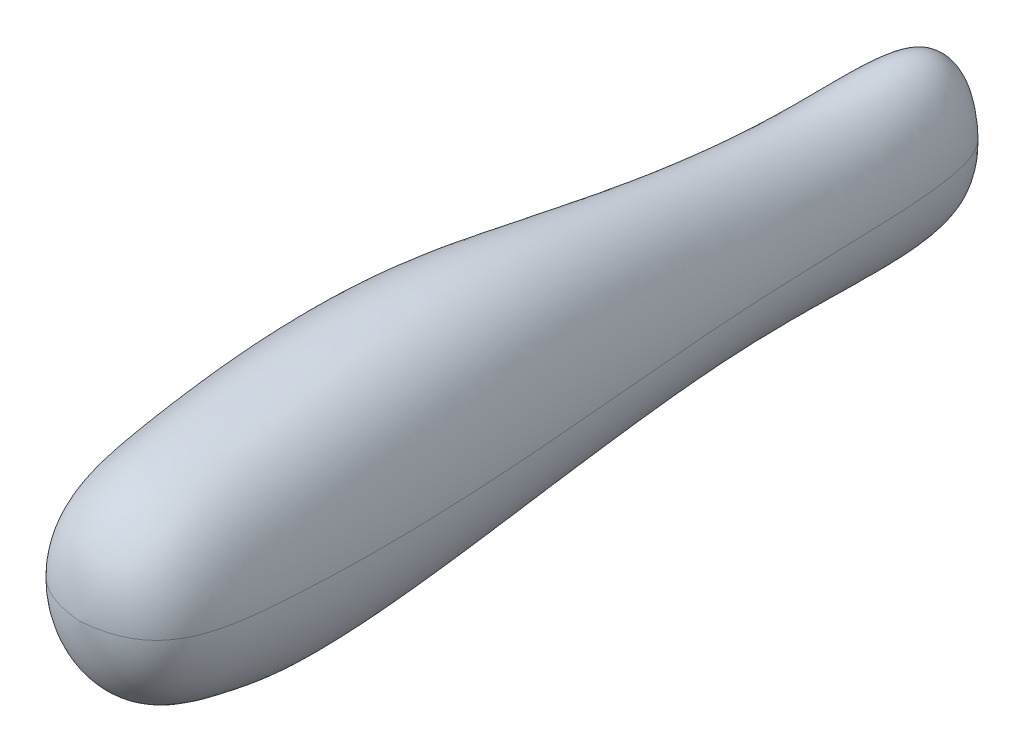
ISO-10303-21;
HEADER;
FILE_DESCRIPTION(('STEP AP214'),'2;1');
FILE_NAME('part.step','',(''),(''),'','','');
FILE_SCHEMA(('AUTOMOTIVE_DESIGN { 1 0 10303 214 1 1 1 1 }'));
ENDSEC;
DATA;
#1=APPLICATION_CONTEXT('core data for automotive mechanical design processes');
#2=APPLICATION_PROTOCOL_DEFINITION('international standard','automotive_design',2000,#1);
#3=PRODUCT_CONTEXT('',#1,'mechanical');
#4=PRODUCT('Part','Part','',(#3));
#5=PRODUCT_RELATED_PRODUCT_CATEGORY('part','',(#4));
#6=PRODUCT_DEFINITION_FORMATION('','',#4);
#7=PRODUCT_DEFINITION_CONTEXT('part definition',#1,'design');
#8=PRODUCT_DEFINITION('design','',#6,#7);
#9=PRODUCT_DEFINITION_SHAPE('','',#8);
#10=(LENGTH_UNIT() NAMED_UNIT(*) SI_UNIT(.MILLI.,.METRE.));
#11=(NAMED_UNIT(*) PLANE_ANGLE_UNIT() SI_UNIT($,.RADIAN.));
#12=(NAMED_UNIT(*) SI_UNIT($,.STERADIAN.) SOLID_ANGLE_UNIT());
#13=UNCERTAINTY_MEASURE_WITH_UNIT(LENGTH_MEASURE(1.E-05),#10,'distance_accuracy_value','');
#14=(GEOMETRIC_REPRESENTATION_CONTEXT(3) GLOBAL_UNCERTAINTY_ASSIGNED_CONTEXT((#13)) GLOBAL_UNIT_ASSIGNED_CONTEXT((#10,
#11,#12)) REPRESENTATION_CONTEXT('',''));
#15=CARTESIAN_POINT('',(0.,0.,0.));
#16=DIRECTION('',(0.,0.,1.));
#17=DIRECTION('',(1.,0.,0.));
#18=AXIS2_PLACEMENT_3D('',#15,#16,#17);
#19=CARTESIAN_POINT('',(204.079130800969,23.172812466691,203.55366286516));
#20=CARTESIAN_POINT('',(204.079130800969,23.172812466691,203.55366286516));
#21=CARTESIAN_POINT('',(204.079130800969,23.172812466691,203.55366286516));
#22=CARTESIAN_POINT('',(204.079130800969,23.172812466691,203.55366286516));
#23=CARTESIAN_POINT('',(204.079130800969,23.172812466691,203.55366286516));
#24=CARTESIAN_POINT('',(204.079130800969,23.172812466691,203.55366286516));
#25=CARTESIAN_POINT('',(204.079130800969,23.172812466691,203.55366286516));
#26=CARTESIAN_POINT('',(228.446348021599,23.172812336409,201.663956001106));
#27=CARTESIAN_POINT('',(228.446347912663,30.7846047284761,201.663956001109));
#28=CARTESIAN_POINT('',(223.173565154511,46.0081892520745,201.663956001109));
#29=CARTESIAN_POINT('',(204.079130800972,55.4669114657685,201.663956001107));
#30=CARTESIAN_POINT('',(184.98469710099,46.0081884704591,201.663956001117));
#31=CARTESIAN_POINT('',(179.711915139516,30.7846044679457,201.663956001111));
#32=CARTESIAN_POINT('',(179.711915248448,23.1728125969489,201.663956001115));
#33=CARTESIAN_POINT('',(235.098969024617,23.1728123008377,167.649331490651));
#34=CARTESIAN_POINT('',(235.098968885954,32.8627398151723,167.649331490652));
#35=CARTESIAN_POINT('',(228.386636219257,52.2425945121602,167.649331490648));
#36=CARTESIAN_POINT('',(204.079130800961,64.2836917870697,167.649331490662));
#37=CARTESIAN_POINT('',(179.77162621468,52.2425935171488,167.649331490658));
#38=CARTESIAN_POINT('',(173.059294562173,32.8627394835153,167.649331490655));
#39=CARTESIAN_POINT('',(173.059294700834,23.1728126325323,167.649331490669));
#40=CARTESIAN_POINT('',(235.098969024623,23.1728123750451,93.0514367049417));
#41=CARTESIAN_POINT('',(235.098968885947,34.8572991008661,82.7804555502548));
#42=CARTESIAN_POINT('',(228.386636219259,58.2262723692105,75.712253518332));
#43=CARTESIAN_POINT('',(204.079130800954,70.2673696440928,75.7122535183184));
#44=CARTESIAN_POINT('',(173.445767749334,58.2262713742114,75.7122535183253));
#45=CARTESIAN_POINT('',(166.733436096823,34.8572987691856,82.7804555502539));
#46=CARTESIAN_POINT('',(166.733436235497,23.1728127067216,93.0514367049448));
#47=CARTESIAN_POINT('',(225.360000997944,23.909585599789,-3.5964441130224));
#48=CARTESIAN_POINT('',(225.36000089106,30.7712887533313,-4.72272252781647));
#49=CARTESIAN_POINT('',(220.185890610066,45.9682413266295,-6.97831727334741));
#50=CARTESIAN_POINT('',(201.448780884544,56.8976297743393,-6.97831727335119));
#51=CARTESIAN_POINT('',(189.564685137818,45.9682404234728,28.5733600990669));
#52=CARTESIAN_POINT('',(180.524773243102,30.7712884522742,46.6297002549572));
#53=CARTESIAN_POINT('',(180.524773349987,23.9095859008565,47.75597866975));
#54=CARTESIAN_POINT('',(222.974014375893,22.0127801573795,-88.5817557809556));
#55=CARTESIAN_POINT('',(222.974014300903,28.4969285711436,-88.0361594976015));
#56=CARTESIAN_POINT('',(219.343886979926,39.1451607800799,-85.853774364172));
#57=CARTESIAN_POINT('',(204.089414342485,48.6441298861113,-76.7379597415512));
#58=CARTESIAN_POINT('',(190.943561643473,39.145159995136,-76.7379597415583));
#59=CARTESIAN_POINT('',(187.313434870997,28.4969283094975,-78.9203448749846));
#60=CARTESIAN_POINT('',(187.31343494599,22.0127804190149,-79.4659411583349));
#61=CARTESIAN_POINT('',(218.997547134608,24.4761486457395,-98.6473785735476));
#62=CARTESIAN_POINT('',(218.997547067958,32.5725578735719,-98.6473785735502));
#63=CARTESIAN_POINT('',(215.771600303875,51.3720486873408,-98.6473785735478));
#64=CARTESIAN_POINT('',(204.089414342492,59.8133968661447,-98.6473785735468));
#65=CARTESIAN_POINT('',(192.407228780965,51.3720479898105,-98.6473785735384));
#66=CARTESIAN_POINT('',(189.181282504312,32.5725576410558,-98.6473785735499));
#67=CARTESIAN_POINT('',(189.181282570963,24.4761488782488,-98.6473785735397));
#68=CARTESIAN_POINT('',(204.089414342496,23.1728124666768,-101.04566944612));
#69=CARTESIAN_POINT('',(204.089414342496,23.1728124666768,-101.04566944612));
#70=CARTESIAN_POINT('',(204.089414342496,23.1728124666768,-101.04566944612));
#71=CARTESIAN_POINT('',(204.089414342496,23.1728124666768,-101.04566944612));
#72=CARTESIAN_POINT('',(204.089414342496,23.1728124666768,-101.04566944612));
#73=CARTESIAN_POINT('',(204.089414342496,23.1728124666768,-101.04566944612));
#74=CARTESIAN_POINT('',(204.089414342496,23.1728124666768,-101.04566944612));
#75=B_SPLINE_SURFACE_WITH_KNOTS('',3,3,((#19,#20,#21,#22,#23,#24,#25),(#26,#27,#28,#29,#30,#31,
#32),(#33,#34,#35,#36,#37,#38,#39),(#40,#41,#42,#43,#44,#45,#46),(#47,#48,#49,#50,#51,#52,#53),
(#54,#55,#56,#57,#58,#59,#60),(#61,#62,#63,#64,#65,#66,#67),(#68,#69,#70,#71,#72,#73,#74)),
.UNSPECIFIED.,.F.,.F.,.F.,(4,1,1,1,1,4),(4,1,1,1,4),(0.,1.,2.,2.582463818436,3.,4.),(2.,3.,4.,
5.,6.),.UNSPECIFIED.);
#76=CARTESIAN_POINT('',(204.079130800969,23.172812466691,203.55366286516));
#77=CARTESIAN_POINT('',(179.711915248448,23.1728125969489,201.663956001115));
#78=CARTESIAN_POINT('',(173.059294700834,23.1728126325323,167.649331490669));
#79=CARTESIAN_POINT('',(166.733436235497,23.1728127067216,93.0514367049448));
#80=CARTESIAN_POINT('',(180.524773349987,23.9095859008565,47.75597866975));
#81=CARTESIAN_POINT('',(187.31343494599,22.0127804190149,-79.4659411583349));
#82=CARTESIAN_POINT('',(189.181282570963,24.4761488782488,-98.6473785735397));
#83=CARTESIAN_POINT('',(204.089414342496,23.1728124666768,-101.04566944612));
#84=B_SPLINE_CURVE_WITH_KNOTS('',3,(#76,#77,#78,#79,#80,#81,#82,#83),.UNSPECIFIED.,.F.,.F.,(4,1,
1,1,1,4),(0.,1.,2.,2.582463818436,3.,4.),.UNSPECIFIED.);
#85=CARTESIAN_POINT('',(174.42358175533,23.1728126308659,168.581491178922));
#86=VERTEX_POINT('',#85);
#87=CARTESIAN_POINT('',(187.661687822029,23.1431852475548,-71.9357518170439));
#88=VERTEX_POINT('',#87);
#89=EDGE_CURVE('E58',#86,#88,#84,.T.);
#90=CARTESIAN_POINT('',(176.272590131765,23.1728126184513,178.544058142151));
#91=CARTESIAN_POINT('',(176.27259147372,23.1742073772134,178.543937120343));
#92=CARTESIAN_POINT('',(176.272592747765,23.1756020852418,178.543815512753));
#93=CARTESIAN_POINT('',(176.27259762969,23.1812471282352,178.543320920337));
#94=CARTESIAN_POINT('',(176.272600674629,23.1854970388554,178.542943080768));
#95=CARTESIAN_POINT('',(176.272612743577,23.2067443598892,178.541026664954));
#96=CARTESIAN_POINT('',(176.272612299722,23.2237344389797,178.539406489905));
#97=CARTESIAN_POINT('',(176.272559498785,23.308655390227,178.530869505678));
#98=CARTESIAN_POINT('',(176.27235535743,23.3764572396979,178.522647899677));
#99=CARTESIAN_POINT('',(176.271250785307,23.5797669271,178.49375460985));
#100=CARTESIAN_POINT('',(176.269856193009,23.7146985041849,178.468882916024));
#101=CARTESIAN_POINT('',(176.265728000614,23.9821802974991,178.408112166413));
#102=CARTESIAN_POINT('',(176.262992861931,24.1147275955657,178.372200457365));
#103=CARTESIAN_POINT('',(176.256112678793,24.3780910018452,178.289074175646));
#104=CARTESIAN_POINT('',(176.251949809566,24.5088623654704,178.241719058315));
#105=CARTESIAN_POINT('',(176.242192108236,24.7660092236984,178.136285656755));
#106=CARTESIAN_POINT('',(176.236596733952,24.8923830332776,178.078203314761));
#107=CARTESIAN_POINT('',(176.223939270042,25.1399105983093,177.951693076617));
#108=CARTESIAN_POINT('',(176.216875851871,25.2610595046003,177.883255824892));
#109=CARTESIAN_POINT('',(176.201253726611,25.4972099279122,177.736548275552));
#110=CARTESIAN_POINT('',(176.192694465996,25.61220914864,177.658274340965));
#111=CARTESIAN_POINT('',(176.17402342929,25.8356084925875,177.492191022658));
#112=CARTESIAN_POINT('',(176.163906231309,25.9439836485927,177.40434866421));
#113=CARTESIAN_POINT('',(176.142116970653,26.1529714219875,177.219971674675));
#114=CARTESIAN_POINT('',(176.130444335534,26.2535811598539,177.123433847671));
#115=CARTESIAN_POINT('',(176.105542072206,26.446238855841,176.922468581194));
#116=CARTESIAN_POINT('',(176.092313444935,26.5382922505879,176.818046228995));
#117=CARTESIAN_POINT('',(176.064285341478,26.7133174673212,176.601982950858));
#118=CARTESIAN_POINT('',(176.049485286801,26.796285921871,176.490339372516));
#119=CARTESIAN_POINT('',(176.018259522726,26.9528939731599,176.260175397742));
#120=CARTESIAN_POINT('',(176.001826932042,27.0264908161852,176.141626845873));
#121=CARTESIAN_POINT('',(175.96741050257,27.1634657146962,175.89892732133));
#122=CARTESIAN_POINT('',(175.949426126776,27.226840210737,175.774774416384));
#123=CARTESIAN_POINT('',(175.911955767562,27.3429303711949,175.521816166715));
#124=CARTESIAN_POINT('',(175.892469935328,27.3956471068393,175.393011291105));
#125=CARTESIAN_POINT('',(175.85205705196,27.4901087728368,175.131658316893));
#126=CARTESIAN_POINT('',(175.831129979576,27.5318535413744,174.999110163117));
#127=CARTESIAN_POINT('',(175.787690740676,27.6045100411465,174.729802380589));
#128=CARTESIAN_POINT('',(175.765164246902,27.6353035153075,174.593013156031));
#129=CARTESIAN_POINT('',(175.71883997655,27.6852694180775,174.317589657337));
#130=CARTESIAN_POINT('',(175.695042615048,27.7044456160306,174.178955996581));
#131=CARTESIAN_POINT('',(175.646290830146,27.7311164630096,173.900714650698));
#132=CARTESIAN_POINT('',(175.621335946422,27.7386064229253,173.761106597152));
#133=CARTESIAN_POINT('',(175.570440805377,27.7418862718452,173.481984332353));
#134=CARTESIAN_POINT('',(175.544500890605,27.7376801921164,173.342470105341));
#135=CARTESIAN_POINT('',(175.491391193502,27.7174907285628,173.062260191718));
#136=CARTESIAN_POINT('',(175.464208526005,27.7013243103574,172.921580117051));
#137=CARTESIAN_POINT('',(175.409216131243,27.6571608101464,172.642267216208));
#138=CARTESIAN_POINT('',(175.381406624593,27.6291678307841,172.503633697324));
#139=CARTESIAN_POINT('',(175.325366066536,27.5615547874272,172.229249639924));
#140=CARTESIAN_POINT('',(175.29713482993,27.5219294636815,172.093500435438));
#141=CARTESIAN_POINT('',(175.240520284688,27.4313579957104,171.825922411031));
#142=CARTESIAN_POINT('',(175.212137033873,27.3804158937658,171.694092210282));
#143=CARTESIAN_POINT('',(175.15509604427,27.2668020135227,171.433480484213));
#144=CARTESIAN_POINT('',(175.126439649441,27.203983806413,171.304762469369));
#145=CARTESIAN_POINT('',(175.069526650293,27.0675160300688,171.053152315772));
#146=CARTESIAN_POINT('',(175.041269949086,26.9938691369127,170.930258747525));
#147=CARTESIAN_POINT('',(174.985462411693,26.8362589041016,170.691189793031));
#148=CARTESIAN_POINT('',(174.957911252248,26.7523003949886,170.575011298293));
#149=CARTESIAN_POINT('',(174.903780357641,26.5744984886449,170.350028398356));
#150=CARTESIAN_POINT('',(174.877201689466,26.4806446482091,170.241231986993));
#151=CARTESIAN_POINT('',(174.825415432539,26.2839589068844,170.032179514216));
#152=CARTESIAN_POINT('',(174.800205033911,26.1811466301056,169.93190569084));
#153=CARTESIAN_POINT('',(174.751405213163,25.9670617109931,169.740404062676));
#154=CARTESIAN_POINT('',(174.727815753874,25.8557892627826,169.649176050436));
#155=CARTESIAN_POINT('',(174.68256152406,25.6255399991445,169.476482578054));
#156=CARTESIAN_POINT('',(174.660896760309,25.5065631566035,169.39501715227));
#157=CARTESIAN_POINT('',(174.619794432485,25.2617970078685,169.242554603141));
#158=CARTESIAN_POINT('',(174.600355757761,25.1360111453983,169.171552254401));
#159=CARTESIAN_POINT('',(174.564333340131,24.8810771826636,169.041894282623));
#160=CARTESIAN_POINT('',(174.547699935776,24.7520480137588,168.983018577476));
#161=CARTESIAN_POINT('',(174.517065267769,24.4892781308021,168.876391985818));
#162=CARTESIAN_POINT('',(174.503062048331,24.3555410061232,168.828632826761));
#163=CARTESIAN_POINT('',(174.477898604555,24.084510593429,168.744686400538));
#164=CARTESIAN_POINT('',(174.466733014175,23.9472245666314,168.708477258339));
#165=CARTESIAN_POINT('',(174.44737767875,23.6699090754356,168.647849109315));
#166=CARTESIAN_POINT('',(174.439186401335,23.5298810630166,168.623424029187));
#167=CARTESIAN_POINT('',(174.430846153904,23.3530931900097,168.600299502843));
#168=CARTESIAN_POINT('',(174.429250634752,23.3170823121991,168.595987417776));
#169=CARTESIAN_POINT('',(174.426263583147,23.2449988811489,168.58815052238));
#170=CARTESIAN_POINT('',(174.42487187126,23.2089264107934,168.584625018089));
#171=CARTESIAN_POINT('',(174.42358175533,23.1728126308659,168.581491178922));
#172=B_SPLINE_CURVE_WITH_KNOTS('',3,(#90,#91,#92,#93,#94,#95,#96,#97,#98,#99,#100,#101,#102,
#103,#104,#105,#106,#107,#108,#109,#110,#111,#112,#113,#114,#115,#116,#117,#118,#119,#120,#121,
#122,#123,#124,#125,#126,#127,#128,#129,#130,#131,#132,#133,#134,#135,#136,#137,#138,#139,#140,
#141,#142,#143,#144,#145,#146,#147,#148,#149,#150,#151,#152,#153,#154,#155,#156,#157,#158,#159,
#160,#161,#162,#163,#164,#165,#166,#167,#168,#169,#170,#171),.UNSPECIFIED.,.F.,.F.,(4,2,2,2,2,2,
2,2,2,2,2,2,2,2,2,2,2,2,2,2,2,2,2,2,2,2,2,2,2,2,2,2,2,2,2,2,2,2,2,2,4),(0.,0.00420000008364134,
0.0170000107265241,0.0682006908011965,0.273044250684372,0.684170611731698,1.09576994382567,
1.51270722794135,1.92980255030937,2.34727699028518,2.764906242104,3.18402320962989,
3.60329485216436,4.02229824552239,4.44145642524628,4.86246308721153,5.28361602968395,
5.70472662037746,6.12584342129689,6.55137863349757,6.97677570240276,7.40234341828722,
7.82776447218186,8.2598342233462,8.69175421209023,9.12386980199625,9.55583129044443,
9.99351435940655,10.4310894455827,10.8684603232399,11.3062974977777,11.7431985761201,
12.1800896325579,12.6169822265928,13.0536558859984,13.4815248556684,13.9090743948471,
14.3358093058406,14.7623240493948,14.8712282208704,14.9800359280779),.UNSPECIFIED.);
#173=CARTESIAN_POINT('',(176.272590131765,23.1728126184513,178.544058142151));
#174=VERTEX_POINT('',#173);
#175=EDGE_CURVE('E69',#174,#86,#172,.T.);
#176=CARTESIAN_POINT('',(204.079130800969,23.172812466691,203.55366286516));
#177=VERTEX_POINT('',#176);
#178=EDGE_CURVE('E68',#177,#174,#84,.T.);
#179=CARTESIAN_POINT('',(204.079130800969,23.172812466691,203.55366286516));
#180=CARTESIAN_POINT('',(228.446348021599,23.172812336409,201.663956001106));
#181=CARTESIAN_POINT('',(235.098969024617,23.1728123008377,167.649331490651));
#182=CARTESIAN_POINT('',(235.098969024623,23.1728123750451,93.0514367049417));
#183=CARTESIAN_POINT('',(225.360000997944,23.909585599789,-3.5964441130224));
#184=CARTESIAN_POINT('',(222.974014375893,22.0127801573795,-88.5817557809556));
#185=CARTESIAN_POINT('',(218.997547134608,24.4761486457395,-98.6473785735476));
#186=CARTESIAN_POINT('',(204.089414342496,23.1728124666768,-101.04566944612));
#187=B_SPLINE_CURVE_WITH_KNOTS('',3,(#179,#180,#181,#182,#183,#184,#185,#186),.UNSPECIFIED.,.F.,
.F.,(4,1,1,1,1,4),(0.,1.,2.,2.582463818436,3.,4.),.UNSPECIFIED.);
#188=CARTESIAN_POINT('',(204.089414342496,23.1728124666768,-101.04566944612));
#189=VERTEX_POINT('',#188);
#190=EDGE_CURVE('E66',#177,#189,#187,.T.);
#191=CARTESIAN_POINT('',(188.888072161777,23.3293355912422,-80.6962567637818));
#192=VERTEX_POINT('',#191);
#193=EDGE_CURVE('E55',#192,#189,#84,.T.);
#194=CARTESIAN_POINT('',(187.661687822029,23.1431852475548,-71.9357518170439));
#195=CARTESIAN_POINT('',(187.661705745453,23.1434802492158,-71.9359059724332));
#196=CARTESIAN_POINT('',(187.661723675763,23.1437752351539,-71.9360601571081));
#197=CARTESIAN_POINT('',(187.661799011984,23.1450141100817,-71.9367078557526));
#198=CARTESIAN_POINT('',(187.661856481513,23.1459578537479,-71.9372016402935));
#199=CARTESIAN_POINT('',(187.662144181682,23.1506757690635,-71.9396720633526));
#200=CARTESIAN_POINT('',(187.662375469342,23.1544475226454,-71.9416531982219));
#201=CARTESIAN_POINT('',(187.663537542095,23.1732935259903,-71.95158292258));
#202=CARTESIAN_POINT('',(187.664485195495,23.1883289051059,-71.9596033606225));
#203=CARTESIAN_POINT('',(187.669313250435,23.2633073106522,-72.0000932741199));
#204=CARTESIAN_POINT('',(187.673460776454,23.3226180180353,-72.0337066641802));
#205=CARTESIAN_POINT('',(187.686752231056,23.4988040490194,-72.1383744395018));
#206=CARTESIAN_POINT('',(187.696721396625,23.6134966027328,-72.2130431656383));
#207=CARTESIAN_POINT('',(187.718635557415,23.8363664999363,-72.371505845472));
#208=CARTESIAN_POINT('',(187.730582768523,23.944536348901,-72.4553099966717));
#209=CARTESIAN_POINT('',(187.756364098404,24.1548400006247,-72.6324886628447));
#210=CARTESIAN_POINT('',(187.770219933105,24.2568814714489,-72.7259696957049));
#211=CARTESIAN_POINT('',(187.799448048057,24.4527986001713,-72.920978884706));
#212=CARTESIAN_POINT('',(187.814820903223,24.5466711366782,-73.0225100887844));
#213=CARTESIAN_POINT('',(187.846834885769,24.7256902861642,-73.2329808223868));
#214=CARTESIAN_POINT('',(187.863477242508,24.8108282488289,-73.3419275216423));
#215=CARTESIAN_POINT('',(187.897768381763,24.9717577323588,-73.5664291839364));
#216=CARTESIAN_POINT('',(187.915417539151,25.0475457382043,-73.6819866084574));
#217=CARTESIAN_POINT('',(187.951764805931,25.1904058783088,-73.9208099239238));
#218=CARTESIAN_POINT('',(187.970475282856,25.2573167767742,-74.0441704179389));
#219=CARTESIAN_POINT('',(188.008443082379,25.3805325799326,-74.2960521566523));
#220=CARTESIAN_POINT('',(188.027700605229,25.4368335416545,-74.4245752985042));
#221=CARTESIAN_POINT('',(188.066523622669,25.5383955521687,-74.6857834635291));
#222=CARTESIAN_POINT('',(188.086088920159,25.5836633828741,-74.8184658731549));
#223=CARTESIAN_POINT('',(188.125342567789,25.6629135595567,-75.0871601824418));
#224=CARTESIAN_POINT('',(188.145030961356,25.6968916636484,-75.2231733129912));
#225=CARTESIAN_POINT('',(188.204458874389,25.7821335977758,-75.6379502023694));
#226=CARTESIAN_POINT('',(188.244134194969,25.8155939104507,-75.9205935629285));
#227=CARTESIAN_POINT('',(188.322089265289,25.8340963640204,-76.4876798837049));
#228=CARTESIAN_POINT('',(188.36036890347,25.8191346430731,-76.7721229856529));
#229=CARTESIAN_POINT('',(188.416175648895,25.7607536558506,-77.1937982906867));
#230=CARTESIAN_POINT('',(188.434519965334,25.7352766753524,-77.3336101515834));
#231=CARTESIAN_POINT('',(188.470625445262,25.6725046602043,-77.6106127826137));
#232=CARTESIAN_POINT('',(188.488386826608,25.6352140973743,-77.7478045237457));
#233=CARTESIAN_POINT('',(188.523295772664,25.5490452504172,-78.0186298436676));
#234=CARTESIAN_POINT('',(188.540443095884,25.5001624637905,-78.1522620174078));
#235=CARTESIAN_POINT('',(188.574091628557,25.3911751231902,-78.4148966373148));
#236=CARTESIAN_POINT('',(188.590593078724,25.3310747990539,-78.5439008067916));
#237=CARTESIAN_POINT('',(188.622888026858,25.2003085671573,-78.7959030381607));
#238=CARTESIAN_POINT('',(188.638683966068,25.1296834742268,-78.9189219681785));
#239=CARTESIAN_POINT('',(188.669631856491,24.9782273366247,-79.1585277642898));
#240=CARTESIAN_POINT('',(188.684784044467,24.897400088339,-79.2751169999054));
#241=CARTESIAN_POINT('',(188.714459216868,24.7261038154211,-79.5010363628372));
#242=CARTESIAN_POINT('',(188.728982335156,24.6356368563994,-79.6103680371969));
#243=CARTESIAN_POINT('',(188.757412976121,24.4457361668595,-79.8209551049077));
#244=CARTESIAN_POINT('',(188.771320641937,24.3463045378052,-79.922212380595));
#245=CARTESIAN_POINT('',(188.803166382171,24.1039688507382,-80.1488286006548));
#246=CARTESIAN_POINT('',(188.82087291159,23.9577525178187,-80.270724966255));
#247=CARTESIAN_POINT('',(188.846649209654,23.7288772500719,-80.4404005378659));
#248=CARTESIAN_POINT('',(188.855106949837,23.6510323745127,-80.4947418688075));
#249=CARTESIAN_POINT('',(188.871773572291,23.4923644591242,-80.5989152052452));
#250=CARTESIAN_POINT('',(188.879982473215,23.411541643535,-80.6487475492973));
#251=CARTESIAN_POINT('',(188.888072161777,23.3293355912422,-80.6962567637818));
#252=B_SPLINE_CURVE_WITH_KNOTS('',3,(#194,#195,#196,#197,#198,#199,#200,#201,#202,#203,#204,
#205,#206,#207,#208,#209,#210,#211,#212,#213,#214,#215,#216,#217,#218,#219,#220,#221,#222,#223,
#224,#225,#226,#227,#228,#229,#230,#231,#232,#233,#234,#235,#236,#237,#238,#239,#240,#241,#242,
#243,#244,#245,#246,#247,#248,#249,#250,#251),.UNSPECIFIED.,.F.,.F.,(4,2,2,2,2,2,2,2,2,2,2,2,2,
2,2,2,2,2,2,2,2,2,2,2,2,2,2,2,4),(0.,0.00100000000572725,0.00420000017389637,0.0170000110395859,
0.0682007064160774,0.273045121262944,0.684188960511753,1.09579653572812,1.51254825519133,
1.92945852471705,2.3467777759271,2.76425343899313,3.18849777055372,3.61289945446372,
4.03703960285137,4.46133893355083,5.31910900311725,6.17694748481084,6.60639864342918,
7.03568743485663,7.4651432388926,7.89443743244594,8.32210818549249,8.74962026198063,
9.17704091411592,9.60436163114441,10.1765100821966,10.4623168277985,10.7481020958413),.UNSPECIFIED.);
#253=EDGE_CURVE('E59',#88,#192,#252,.T.);
#254=ORIENTED_EDGE('',*,*,#89,.F.);
#255=ORIENTED_EDGE('',*,*,#175,.F.);
#256=ORIENTED_EDGE('',*,*,#178,.F.);
#257=ORIENTED_EDGE('',*,*,#190,.T.);
#258=ORIENTED_EDGE('',*,*,#193,.F.);
#259=ORIENTED_EDGE('',*,*,#253,.F.);
#260=EDGE_LOOP('',(#254,#255,#256,#257,#258,#259));
#261=FACE_BOUND('',#260,.T.);
#262=ADVANCED_FACE('F16',(#261),#75,.T.);
#263=CARTESIAN_POINT('',(204.079130800969,23.172812466691,203.55366286516));
#264=CARTESIAN_POINT('',(204.079130800969,23.172812466691,203.55366286516));
#265=CARTESIAN_POINT('',(204.079130800969,23.172812466691,203.55366286516));
#266=CARTESIAN_POINT('',(204.079130800969,23.172812466691,203.55366286516));
#267=CARTESIAN_POINT('',(204.079130800969,23.172812466691,203.55366286516));
#268=CARTESIAN_POINT('',(204.079130800969,23.172812466691,203.55366286516));
#269=CARTESIAN_POINT('',(204.079130800969,23.172812466691,203.55366286516));
#270=CARTESIAN_POINT('',(179.711915248448,23.1728125969489,201.663956001115));
#271=CARTESIAN_POINT('',(179.711915357376,15.561020725966,201.663956001106));
#272=CARTESIAN_POINT('',(184.984697754569,0.337437244539163,201.663956001107));
#273=CARTESIAN_POINT('',(204.07913080096,-9.12128432163473,201.663956001108));
#274=CARTESIAN_POINT('',(223.173563193782,0.337438026159154,201.663956001104));
#275=CARTESIAN_POINT('',(228.446344794298,15.5610209864981,201.663956001097));
#276=CARTESIAN_POINT('',(228.446344685373,23.1728123364084,201.663956001106));
#277=CARTESIAN_POINT('',(173.059294700834,23.1728126325323,167.649331490669));
#278=CARTESIAN_POINT('',(173.059294839499,13.4828857815449,167.649331490653));
#279=CARTESIAN_POINT('',(179.771627046683,-5.89696758878799,167.649331490655));
#280=CARTESIAN_POINT('',(204.079130800954,-17.9380640393743,167.649331490662));
#281=CARTESIAN_POINT('',(228.386633723224,-5.89696659376415,167.649331490654));
#282=CARTESIAN_POINT('',(235.098964916242,13.4828861131964,167.649331490655));
#283=CARTESIAN_POINT('',(235.098964777564,23.1728123008411,167.649331490658));
#284=CARTESIAN_POINT('',(166.733436235497,23.1728127067216,93.0514367049448));
#285=CARTESIAN_POINT('',(166.733436374164,11.4883266442746,103.322417859631));
#286=CARTESIAN_POINT('',(173.445768581345,-11.8806450005609,137.338140446443));
#287=CARTESIAN_POINT('',(204.079130800956,-23.9217414511543,137.338140446447));
#288=CARTESIAN_POINT('',(228.386633723232,-11.8806440055406,137.338140446448));
#289=CARTESIAN_POINT('',(235.098964916236,11.4883269759365,103.322417859643));
#290=CARTESIAN_POINT('',(235.098964777566,23.1728123750552,93.0514367049472));
#291=CARTESIAN_POINT('',(180.524773349987,23.9095859008565,47.75597866975));
#292=CARTESIAN_POINT('',(180.52477345688,17.0478833494092,48.8822570845363));
#293=CARTESIAN_POINT('',(189.564685779151,4.79802511486715,35.3310305878199));
#294=CARTESIAN_POINT('',(201.448780884529,-6.13136258466174,-0.220646784596767));
#295=CARTESIAN_POINT('',(220.18588868603,4.79802601800383,-0.22064678460143));
#296=CARTESIAN_POINT('',(225.359997831051,17.0478836504616,-2.47016569822167));
#297=CARTESIAN_POINT('',(225.359997724166,23.9095855997894,-3.59644411301729));
#298=CARTESIAN_POINT('',(187.31343494599,22.0127804190149,-79.4659411583349));
#299=CARTESIAN_POINT('',(187.313435020983,15.5286325285277,-80.0115374416943));
#300=CARTESIAN_POINT('',(190.943562093437,0.240272652245244,-80.0115374416925));
#301=CARTESIAN_POINT('',(204.089414342491,-9.25869580351868,-80.0115374417016));
#302=CARTESIAN_POINT('',(219.343885630038,0.240273437192129,-89.1273520643103));
#303=CARTESIAN_POINT('',(222.974012154013,15.5286327901939,-89.1273520643061));
#304=CARTESIAN_POINT('',(222.974012079034,22.0127801573848,-88.5817557809556));
#305=CARTESIAN_POINT('',(189.181282570963,24.4761488782488,-98.6473785735397));
#306=CARTESIAN_POINT('',(189.181282637604,16.3797401154421,-98.6473785735493));
#307=CARTESIAN_POINT('',(192.407229180827,2.79359541297453,-98.6473785735417));
#308=CARTESIAN_POINT('',(204.089414342491,-5.6477521879631,-98.6473785735361));
#309=CARTESIAN_POINT('',(215.771599104287,2.79359611053032,-98.6473785735459));
#310=CARTESIAN_POINT('',(218.997545160118,16.3797403479676,-98.6473785735349));
#311=CARTESIAN_POINT('',(218.997545093476,24.4761486457337,-98.647378573543));
#312=CARTESIAN_POINT('',(204.089414342496,23.1728124666768,-101.04566944612));
#313=CARTESIAN_POINT('',(204.089414342496,23.1728124666768,-101.04566944612));
#314=CARTESIAN_POINT('',(204.089414342496,23.1728124666768,-101.04566944612));
#315=CARTESIAN_POINT('',(204.089414342496,23.1728124666768,-101.04566944612));
#316=CARTESIAN_POINT('',(204.089414342496,23.1728124666768,-101.04566944612));
#317=CARTESIAN_POINT('',(204.089414342496,23.1728124666768,-101.04566944612));
#318=CARTESIAN_POINT('',(204.089414342496,23.1728124666768,-101.04566944612));
#319=B_SPLINE_SURFACE_WITH_KNOTS('',3,3,((#263,#264,#265,#266,#267,#268,#269),(#270,#271,#272,
#273,#274,#275,#276),(#277,#278,#279,#280,#281,#282,#283),(#284,#285,#286,#287,#288,#289,#290),
(#291,#292,#293,#294,#295,#296,#297),(#298,#299,#300,#301,#302,#303,#304),(#305,#306,#307,#308,
#309,#310,#311),(#312,#313,#314,#315,#316,#317,#318)),.UNSPECIFIED.,.F.,.F.,.F.,(4,1,1,1,1,4),
(4,1,1,1,4),(0.,1.,2.,2.582463818436,3.,4.),(6.,7.,8.,9.,10.),.UNSPECIFIED.);
#320=CARTESIAN_POINT('',(174.42358175533,23.1728126308659,168.581491178922));
#321=CARTESIAN_POINT('',(174.423531964146,23.1714187538336,168.581370233661));
#322=CARTESIAN_POINT('',(174.423482324673,23.1700248206283,168.581249872961));
#323=CARTESIAN_POINT('',(174.423282017084,23.1643824810402,168.580765064763));
#324=CARTESIAN_POINT('',(174.423132606645,23.1601336131226,168.580405462705));
#325=CARTESIAN_POINT('',(174.422392598834,23.1388865338017,168.578634594363));
#326=CARTESIAN_POINT('',(174.421823158436,23.1218807701488,168.577304811815));
#327=CARTESIAN_POINT('',(174.419088558455,23.0368014850852,168.571089791913));
#328=CARTESIAN_POINT('',(174.41726273291,22.9686193323764,168.567509944768));
#329=CARTESIAN_POINT('',(174.412869504433,22.7633818165774,168.560949124143));
#330=CARTESIAN_POINT('',(174.411408173338,22.6261429752066,168.562204983979));
#331=CARTESIAN_POINT('',(174.411441412439,22.3520914896139,168.576000230224));
#332=CARTESIAN_POINT('',(174.412939407845,22.2152795230409,168.588552682487));
#333=CARTESIAN_POINT('',(174.418846515482,21.9440399341723,168.624747844842));
#334=CARTESIAN_POINT('',(174.423237834332,21.809602863082,168.648322514712));
#335=CARTESIAN_POINT('',(174.434843383174,21.5431723072618,168.706357964673));
#336=CARTESIAN_POINT('',(174.442058678837,21.4111797647297,168.740822853412));
#337=CARTESIAN_POINT('',(174.459208256985,21.1504953281738,168.820393214416));
#338=CARTESIAN_POINT('',(174.469144956572,21.0218064800923,168.865508140912));
#339=CARTESIAN_POINT('',(174.491592313204,20.7686873666798,168.966021072658));
#340=CARTESIAN_POINT('',(174.504103934553,20.6442587172073,169.021422929585));
#341=CARTESIAN_POINT('',(174.531564793221,20.4001650202221,169.142253661387));
#342=CARTESIAN_POINT('',(174.546521482907,20.2805159731551,169.207713153235));
#343=CARTESIAN_POINT('',(174.578646993853,20.0471347518688,169.348057888791));
#344=CARTESIAN_POINT('',(174.595816619161,19.9334047494683,169.422946558274));
#345=CARTESIAN_POINT('',(174.632129993553,19.7126952932379,169.581531353454));
#346=CARTESIAN_POINT('',(174.651272638966,19.6057121187683,169.665222555708));
#347=CARTESIAN_POINT('',(174.691309437798,19.3990527674348,169.840877854904));
#348=CARTESIAN_POINT('',(174.712204245904,19.299379348133,169.932845045072));
#349=CARTESIAN_POINT('',(174.756045707171,19.105538711358,170.126837093494));
#350=CARTESIAN_POINT('',(174.779031152983,19.0115773326467,170.229058933356));
#351=CARTESIAN_POINT('',(174.826313678549,18.8325758092235,170.440813271987));
#352=CARTESIAN_POINT('',(174.85061124158,18.7475389860012,170.550348467958));
#353=CARTESIAN_POINT('',(174.900235040577,18.5869612389122,170.775929234528));
#354=CARTESIAN_POINT('',(174.925561078315,18.5114184965419,170.891973552187));
#355=CARTESIAN_POINT('',(174.976978058608,18.3702586138144,171.129803678951));
#356=CARTESIAN_POINT('',(175.003069282696,18.3046451828226,171.251591611564));
#357=CARTESIAN_POINT('',(175.083440715397,18.120276240987,171.630726936381));
#358=CARTESIAN_POINT('',(175.138563391387,18.0180297796559,171.896183976406));
#359=CARTESIAN_POINT('',(175.248753754135,17.8599437150618,172.440394703461));
#360=CARTESIAN_POINT('',(175.303821437138,17.8041070889113,172.71914924229));
#361=CARTESIAN_POINT('',(175.412689680986,17.7400886799186,173.285561481334));
#362=CARTESIAN_POINT('',(175.466471354205,17.7324035465113,173.573281303322));
#363=CARTESIAN_POINT('',(175.544506514541,17.757917674556,174.00283269333));
#364=CARTESIAN_POINT('',(175.570091716798,17.7726138957668,174.145754699304));
#365=CARTESIAN_POINT('',(175.620245272661,17.8142779658529,174.429964475431));
#366=CARTESIAN_POINT('',(175.644814015169,17.8412410730772,174.571252855429));
#367=CARTESIAN_POINT('',(175.69265490813,17.9070957526221,174.850313849678));
#368=CARTESIAN_POINT('',(175.715933962044,17.9459146809106,174.98810248737));
#369=CARTESIAN_POINT('',(175.761238345943,18.0352796158185,175.259978620026));
#370=CARTESIAN_POINT('',(175.783264158145,18.0858210733665,175.394067528185));
#371=CARTESIAN_POINT('',(175.82599062212,18.1983348094243,175.657635462127));
#372=CARTESIAN_POINT('',(175.846690817485,18.2603109967006,175.787112893443));
#373=CARTESIAN_POINT('',(175.886682815434,18.3952425135377,176.040378039756));
#374=CARTESIAN_POINT('',(175.905975165615,18.4681935401567,176.164167959952));
#375=CARTESIAN_POINT('',(175.94287112894,18.6235785396979,176.40360325179));
#376=CARTESIAN_POINT('',(175.960493340638,18.705877810976,176.519333189162));
#377=CARTESIAN_POINT('',(175.994288199675,18.8801020636272,176.743459763));
#378=CARTESIAN_POINT('',(176.01046140963,18.9720232786747,176.851859241686));
#379=CARTESIAN_POINT('',(176.041351169854,19.1648988989481,177.060576355218));
#380=CARTESIAN_POINT('',(176.056067352187,19.2658555736632,177.160891947494));
#381=CARTESIAN_POINT('',(176.08402518296,19.4760251569247,177.352606879328));
#382=CARTESIAN_POINT('',(176.097267396336,19.5852348751619,177.44400963327));
#383=CARTESIAN_POINT('',(176.122141869194,19.8098744209939,177.616254750829));
#384=CARTESIAN_POINT('',(176.133790713626,19.9252194629328,177.697205315937));
#385=CARTESIAN_POINT('',(176.155655877923,20.1623818574266,177.849108284009));
#386=CARTESIAN_POINT('',(176.165872746359,20.2841967066899,177.920064515717));
#387=CARTESIAN_POINT('',(176.184896449644,20.5335676810563,178.05153036199));
#388=CARTESIAN_POINT('',(176.193702168171,20.6611282502578,178.112031708906));
#389=CARTESIAN_POINT('',(176.209902311125,20.920935699666,178.222039022318));
#390=CARTESIAN_POINT('',(176.217297266941,21.0531807930229,178.271549130008));
#391=CARTESIAN_POINT('',(176.230651420342,21.3206456895374,178.358963785092));
#392=CARTESIAN_POINT('',(176.236618931453,21.4558430013746,178.39693589897));
#393=CARTESIAN_POINT('',(176.247182586925,21.7289516498889,178.461372442369));
#394=CARTESIAN_POINT('',(176.251779263902,21.8668619102343,178.487841343112));
#395=CARTESIAN_POINT('',(176.259605239161,22.1442401361381,178.529060791092));
#396=CARTESIAN_POINT('',(176.262836608653,22.283705410367,178.543829118439));
#397=CARTESIAN_POINT('',(176.267943783334,22.5633488651651,178.561593954143));
#398=CARTESIAN_POINT('',(176.269820381542,22.7035265802297,178.564597353696));
#399=CARTESIAN_POINT('',(176.271490435802,22.8985388833187,178.560582379378));
#400=CARTESIAN_POINT('',(176.271856878262,22.9535066442999,178.558542257376));
#401=CARTESIAN_POINT('',(176.272380232404,23.0632776392499,178.552653352734));
#402=CARTESIAN_POINT('',(176.27253740411,23.1180809928169,178.548806822652));
#403=CARTESIAN_POINT('',(176.272590131765,23.1728126184513,178.544058142151));
#404=B_SPLINE_CURVE_WITH_KNOTS('',3,(#320,#321,#322,#323,#324,#325,#326,#327,#328,#329,#330,
#331,#332,#333,#334,#335,#336,#337,#338,#339,#340,#341,#342,#343,#344,#345,#346,#347,#348,#349,
#350,#351,#352,#353,#354,#355,#356,#357,#358,#359,#360,#361,#362,#363,#364,#365,#366,#367,#368,
#369,#370,#371,#372,#373,#374,#375,#376,#377,#378,#379,#380,#381,#382,#383,#384,#385,#386,#387,
#388,#389,#390,#391,#392,#393,#394,#395,#396,#397,#398,#399,#400,#401,#402,#403),.UNSPECIFIED.,
.F.,.F.,(4,2,2,2,2,2,2,2,2,2,2,2,2,2,2,2,2,2,2,2,2,2,2,2,2,2,2,2,2,2,2,2,2,2,2,2,2,2,2,2,2,4),
(0.,0.00420000010476018,0.0170000112549014,0.068200725730241,0.273046536977429,
0.684267210361366,1.09596412157079,1.505152516804,1.91449547483978,2.32420318965863,
2.73406461948567,3.14519939762543,3.5564839811143,3.96753973559772,4.37874976917777,
4.80046964244676,5.2223459165168,5.64414126053166,6.06609379078287,6.93094402519585,
7.79584973400803,8.66966185992645,9.10703830772332,9.54424583516111,9.97882645734836,
10.413238716523,10.8477997481457,11.2821908418894,11.7109694297717,12.139580803701,
12.5683001382222,12.9968545858225,13.4205390915758,13.8440608433344,14.267915995441,
14.6916111786335,15.112775136882,15.5337752447568,15.9541343700815,16.3742472371393,
16.5392438476621,16.7040352543407),.UNSPECIFIED.);
#405=EDGE_CURVE('E31',#86,#174,#404,.T.);
#406=CARTESIAN_POINT('',(188.888072161777,23.3293355912422,-80.6962567637818));
#407=CARTESIAN_POINT('',(188.888100459005,23.3290480284326,-80.6964229504541));
#408=CARTESIAN_POINT('',(188.888128754742,23.3287604489547,-80.6965891085362));
#409=CARTESIAN_POINT('',(188.888247590584,23.3275525451178,-80.6972868524164));
#410=CARTESIAN_POINT('',(188.888338116917,23.3266320667882,-80.6978181740183));
#411=CARTESIAN_POINT('',(188.888790672549,23.3220288199674,-80.7004733193083));
#412=CARTESIAN_POINT('',(188.889152472924,23.3183434943396,-80.7025927499936));
#413=CARTESIAN_POINT('',(188.890960271536,23.2999031040906,-80.713166541418));
#414=CARTESIAN_POINT('',(188.892402607234,23.2851072892916,-80.7215505062903));
#415=CARTESIAN_POINT('',(188.899595900234,23.2109026856732,-80.7630994777641));
#416=CARTESIAN_POINT('',(188.905288320961,23.1508516597927,-80.7951320726679));
#417=CARTESIAN_POINT('',(188.922216884099,22.9683612459749,-80.887738337077));
#418=CARTESIAN_POINT('',(188.933264030919,22.8439828541668,-80.9445755350432));
#419=CARTESIAN_POINT('',(188.954848286966,22.5908224793658,-81.0479384897426));
#420=CARTESIAN_POINT('',(188.965384807344,22.4620356914649,-81.0944525531961));
#421=CARTESIAN_POINT('',(188.986045166266,22.1993755541439,-81.1772987784236));
#422=CARTESIAN_POINT('',(188.996162046709,22.0654583305361,-81.2134938337924));
#423=CARTESIAN_POINT('',(189.015810008449,21.7949901989023,-81.2746514938054));
#424=CARTESIAN_POINT('',(189.025340872402,21.6584383381083,-81.2996099524212));
#425=CARTESIAN_POINT('',(189.043780735523,21.3835633331036,-81.3381104818622));
#426=CARTESIAN_POINT('',(189.052689153696,21.2452386729604,-81.3516420139364));
#427=CARTESIAN_POINT('',(189.069827841256,20.967850082,-81.3671481801049));
#428=CARTESIAN_POINT('',(189.078057858777,20.8287858968394,-81.3691185408395));
#429=CARTESIAN_POINT('',(189.093878465795,20.5491526844308,-81.3614174848416));
#430=CARTESIAN_POINT('',(189.101459510793,20.4085872070946,-81.3515965735739));
#431=CARTESIAN_POINT('',(189.115795457464,20.1286921967859,-81.3201161483831));
#432=CARTESIAN_POINT('',(189.122550048047,19.9893631474118,-81.2984521932584));
#433=CARTESIAN_POINT('',(189.135148001342,19.7130779252552,-81.2434443732823));
#434=CARTESIAN_POINT('',(189.140991926891,19.5761203336997,-81.2101077644099));
#435=CARTESIAN_POINT('',(189.151690147316,19.3054218182847,-81.1319663750923));
#436=CARTESIAN_POINT('',(189.156544076959,19.1716820975699,-81.0871573758955));
#437=CARTESIAN_POINT('',(189.165149949818,18.9089639192049,-80.9865929251669));
#438=CARTESIAN_POINT('',(189.168906242928,18.7799684882833,-80.9308821849636));
#439=CARTESIAN_POINT('',(189.17524734144,18.5270521322109,-80.8087689792463));
#440=CARTESIAN_POINT('',(189.177831713815,18.4031330981598,-80.7423625739228));
#441=CARTESIAN_POINT('',(189.181725457037,18.1613528967426,-80.5993684413379));
#442=CARTESIAN_POINT('',(189.183035274356,18.0434896217831,-80.5227842899907));
#443=CARTESIAN_POINT('',(189.184279092867,17.8145796388109,-80.3599336077557));
#444=CARTESIAN_POINT('',(189.184212587831,17.7035354540068,-80.2736635258659));
#445=CARTESIAN_POINT('',(189.182604344774,17.4896418681847,-80.0925352689255));
#446=CARTESIAN_POINT('',(189.181069905467,17.3867546494219,-79.9977216847385));
#447=CARTESIAN_POINT('',(189.176438424786,17.1892653108616,-79.7997912163752));
#448=CARTESIAN_POINT('',(189.173340808146,17.0946662562529,-79.6966712871212));
#449=CARTESIAN_POINT('',(189.165493763008,16.9145050809195,-79.4829476567718));
#450=CARTESIAN_POINT('',(189.160745004444,16.8289393133605,-79.372347005539));
#451=CARTESIAN_POINT('',(189.149514052406,16.6673752507481,-79.1443898277006));
#452=CARTESIAN_POINT('',(189.143031221119,16.5913804911972,-79.027030827773));
#453=CARTESIAN_POINT('',(189.128294058162,16.4497929410152,-78.786895394138));
#454=CARTESIAN_POINT('',(189.120046547086,16.3841617457334,-78.664141224989));
#455=CARTESIAN_POINT('',(189.101721806093,16.2633860376256,-78.4136939231748));
#456=CARTESIAN_POINT('',(189.091643905166,16.2082453857926,-78.2859989928141));
#457=CARTESIAN_POINT('',(189.05862173091,16.0592052596499,-77.8969729586195));
#458=CARTESIAN_POINT('',(189.032873316354,15.9815336627627,-77.6294386944706));
#459=CARTESIAN_POINT('',(188.973971196028,15.8715641976329,-77.0854773575737));
#460=CARTESIAN_POINT('',(188.94080003767,15.8393745945443,-76.80903066273));
#461=CARTESIAN_POINT('',(188.867669521573,15.8210865285033,-76.2555211602385));
#462=CARTESIAN_POINT('',(188.8277097727,15.8349907221609,-75.9784583179987));
#463=CARTESIAN_POINT('',(188.741512246331,15.9086099711722,-75.4277604089896));
#464=CARTESIAN_POINT('',(188.695202424927,15.9688938733611,-75.1542111126974));
#465=CARTESIAN_POINT('',(188.622590978559,16.0924846304827,-74.7550168702675));
#466=CARTESIAN_POINT('',(188.597847729695,16.1392451088164,-74.6237355245651));
#467=CARTESIAN_POINT('',(188.547542231838,16.2434805250455,-74.3656742007472));
#468=CARTESIAN_POINT('',(188.521980267441,16.3009517725205,-74.2388926900606));
#469=CARTESIAN_POINT('',(188.46980069126,16.427399746161,-73.9882883718366));
#470=CARTESIAN_POINT('',(188.443172242561,16.4965751799703,-73.8645682589008));
#471=CARTESIAN_POINT('',(188.389633595158,16.6451164427239,-73.6235289517516));
#472=CARTESIAN_POINT('',(188.362723497943,16.724478709704,-73.5062075404809));
#473=CARTESIAN_POINT('',(188.308910465574,16.8929048756689,-73.2786648825203));
#474=CARTESIAN_POINT('',(188.282007538663,16.9819729913606,-73.1684467552116));
#475=CARTESIAN_POINT('',(188.228552117678,17.1691504238205,-72.9559581893182));
#476=CARTESIAN_POINT('',(188.201999498351,17.2672564031081,-72.8536848424163));
#477=CARTESIAN_POINT('',(188.149284530057,17.4729760584242,-72.656711306631));
#478=CARTESIAN_POINT('',(188.123129313887,17.5806795900403,-72.5621030121568));
#479=CARTESIAN_POINT('',(188.07185331215,17.8039193774221,-72.3824093103049));
#480=CARTESIAN_POINT('',(188.046732138979,17.9194526544837,-72.2973203137545));
#481=CARTESIAN_POINT('',(187.997841845214,18.1576536296088,-72.1372351986963));
#482=CARTESIAN_POINT('',(187.974073269206,18.2803241616511,-72.0622431290722));
#483=CARTESIAN_POINT('',(187.928237114649,18.5318629743354,-71.9230131533469));
#484=CARTESIAN_POINT('',(187.906168851283,18.660728725477,-71.8587709053135));
#485=CARTESIAN_POINT('',(187.864278078903,18.9222769973076,-71.7422151450349));
#486=CARTESIAN_POINT('',(187.844432574803,19.0548982410102,-71.689772422455));
#487=CARTESIAN_POINT('',(187.806983102171,19.3243667148432,-71.5963486504225));
#488=CARTESIAN_POINT('',(187.789378221367,19.4612121966896,-71.5553629280555));
#489=CARTESIAN_POINT('',(187.756643427813,19.7382222695083,-71.4851916335423));
#490=CARTESIAN_POINT('',(187.741514096339,19.8783876311925,-71.4560088304432));
#491=CARTESIAN_POINT('',(187.713949347489,20.1609069131285,-71.4097559610168));
#492=CARTESIAN_POINT('',(187.701512813136,20.3032598996064,-71.3926808656806));
#493=CARTESIAN_POINT('',(187.679792400801,20.5851756773909,-71.3711183663607));
#494=CARTESIAN_POINT('',(187.670430943281,20.7247069572907,-71.3662963609211));
#495=CARTESIAN_POINT('',(187.654506219009,21.0037878222068,-71.3683486520744));
#496=CARTESIAN_POINT('',(187.647941830157,21.1433373773746,-71.3752182528186));
#497=CARTESIAN_POINT('',(187.637659318398,21.4214558138623,-71.400628122747));
#498=CARTESIAN_POINT('',(187.633940679488,21.5600248684537,-71.4191662750308));
#499=CARTESIAN_POINT('',(187.62934670199,21.8351176210274,-71.4677758241131));
#500=CARTESIAN_POINT('',(187.628470685133,21.9716417991911,-71.4978444677436));
#501=CARTESIAN_POINT('',(187.629685477921,22.28640875411,-71.5811545766476));
#502=CARTESIAN_POINT('',(187.632852970659,22.4635206688617,-71.6387706807044));
#503=CARTESIAN_POINT('',(187.641113148973,22.7232363756133,-71.7395710697496));
#504=CARTESIAN_POINT('',(187.644448842002,22.808775297095,-71.7755458369851));
#505=CARTESIAN_POINT('',(187.652240294862,22.9776705089527,-71.8521707052516));
#506=CARTESIAN_POINT('',(187.656695944336,23.0610270134839,-71.8928203454217));
#507=CARTESIAN_POINT('',(187.661687822029,23.1431852475548,-71.9357518170439));
#508=B_SPLINE_CURVE_WITH_KNOTS('',3,(#406,#407,#408,#409,#410,#411,#412,#413,#414,#415,#416,
#417,#418,#419,#420,#421,#422,#423,#424,#425,#426,#427,#428,#429,#430,#431,#432,#433,#434,#435,
#436,#437,#438,#439,#440,#441,#442,#443,#444,#445,#446,#447,#448,#449,#450,#451,#452,#453,#454,
#455,#456,#457,#458,#459,#460,#461,#462,#463,#464,#465,#466,#467,#468,#469,#470,#471,#472,#473,
#474,#475,#476,#477,#478,#479,#480,#481,#482,#483,#484,#485,#486,#487,#488,#489,#490,#491,#492,
#493,#494,#495,#496,#497,#498,#499,#500,#501,#502,#503,#504,#505,#506,#507),.UNSPECIFIED.,.F.,
.F.,(4,2,2,2,2,2,2,2,2,2,2,2,2,2,2,2,2,2,2,2,2,2,2,2,2,2,2,2,2,2,2,2,2,2,2,2,2,2,2,2,2,2,2,2,2,
2,2,2,2,2,4),(0.,0.00100000000365189,0.00420000016454985,0.0170000105228962,0.0682006734476889,
0.273043141745947,0.684131864397691,1.09568388777233,1.51247326867012,1.92941630883768,
2.34674346583456,2.7642248698966,3.18705564030396,3.6100450832814,4.03277205213577,
4.45565469455397,4.87683800480657,5.29817681666175,5.71936798210277,6.1407140696479,
6.55997601266413,6.97939236136647,7.39863873444899,7.81803952449114,8.23584767867724,
8.65380930887571,9.48883141012772,10.325837865061,11.1628925615905,12.0103806814128,
12.4346079435547,12.8586893065381,13.2908669380817,13.7228938624337,14.155109234926,
14.587165634902,15.0238074869592,15.4602841479759,15.8969353188206,16.33340969509,
16.7648426455211,17.196099371752,17.6274572152064,18.0586357864798,18.4779068569684,
18.8970095700145,19.3160362716412,19.7349629833075,20.2923992465638,20.5708413062835,
20.8492559399749),.UNSPECIFIED.);
#509=EDGE_CURVE('E11',#192,#88,#508,.T.);
#510=ORIENTED_EDGE('',*,*,#193,.T.);
#511=ORIENTED_EDGE('',*,*,#190,.F.);
#512=ORIENTED_EDGE('',*,*,#178,.T.);
#513=ORIENTED_EDGE('',*,*,#405,.F.);
#514=ORIENTED_EDGE('',*,*,#89,.T.);
#515=ORIENTED_EDGE('',*,*,#509,.F.);
#516=EDGE_LOOP('',(#510,#511,#512,#513,#514,#515));
#517=FACE_BOUND('',#516,.T.);
#518=ADVANCED_FACE('F18',(#517),#319,.T.);
#519=CARTESIAN_POINT('',(203.837642669997,22.7405917600175,173.562774659998));
#520=DIRECTION('',(-1.,0.,0.));
#521=DIRECTION('',(0.,0.,-1.00000000000001));
#522=AXIS2_PLACEMENT_3D('',#519,#520,#521);
#523=CYLINDRICAL_SURFACE('',#522,5.);
#524=CARTESIAN_POINT('',(203.837642669997,22.7405917600175,173.562774659998));
#525=DIRECTION('',(1.,0.,0.));
#526=DIRECTION('',(0.,0.,-1.00000000000001));
#527=AXIS2_PLACEMENT_3D('',#524,#525,#526);
#528=CIRCLE('',#527,5.);
#529=CARTESIAN_POINT('',(203.837642669997,22.7405917600175,168.562774659998));
#530=VERTEX_POINT('',#529);
#531=EDGE_CURVE('E62',#530,#530,#528,.T.);
#532=ORIENTED_EDGE('',*,*,#531,.T.);
#533=EDGE_LOOP('',(#532));
#534=FACE_BOUND('',#533,.T.);
#535=ORIENTED_EDGE('',*,*,#405,.T.);
#536=ORIENTED_EDGE('',*,*,#175,.T.);
#537=EDGE_LOOP('',(#535,#536));
#538=FACE_BOUND('',#537,.T.);
#539=ADVANCED_FACE('F78',(#534,#538),#523,.F.);
#540=CARTESIAN_POINT('',(203.837642669997,22.7405917600175,173.562774659998));
#541=DIRECTION('',(-1.,0.,0.));
#542=DIRECTION('',(0.,0.,-1.00000000000001));
#543=AXIS2_PLACEMENT_3D('',#540,#541,#542);
#544=PLANE('',#543);
#545=ORIENTED_EDGE('',*,*,#531,.F.);
#546=EDGE_LOOP('',(#545));
#547=FACE_BOUND('',#546,.T.);
#548=ADVANCED_FACE('F82',(#547),#544,.T.);
#549=CARTESIAN_POINT('',(203.976821900005,20.8275043999973,-76.3671875000058));
#550=DIRECTION('',(-1.,0.,0.));
#551=DIRECTION('',(0.,0.,-1.00000000000001));
#552=AXIS2_PLACEMENT_3D('',#549,#550,#551);
#553=CYLINDRICAL_SURFACE('',#552,5.);
#554=CARTESIAN_POINT('',(203.976821900005,20.8275043999973,-76.3671875000058));
#555=DIRECTION('',(1.,0.,0.));
#556=DIRECTION('',(0.,0.,-1.00000000000001));
#557=AXIS2_PLACEMENT_3D('',#554,#555,#556);
#558=CIRCLE('',#557,5.);
#559=CARTESIAN_POINT('',(203.976821900005,20.8275043999973,-81.3671875000059));
#560=VERTEX_POINT('',#559);
#561=EDGE_CURVE('E63',#560,#560,#558,.T.);
#562=ORIENTED_EDGE('',*,*,#561,.T.);
#563=EDGE_LOOP('',(#562));
#564=FACE_BOUND('',#563,.T.);
#565=ORIENTED_EDGE('',*,*,#509,.T.);
#566=ORIENTED_EDGE('',*,*,#253,.T.);
#567=EDGE_LOOP('',(#565,#566));
#568=FACE_BOUND('',#567,.T.);
#569=ADVANCED_FACE('F60',(#564,#568),#553,.F.);
#570=CARTESIAN_POINT('',(203.976821900005,20.8275043999973,-76.3671875000058));
#571=DIRECTION('',(-1.,0.,0.));
#572=DIRECTION('',(0.,0.,-1.00000000000001));
#573=AXIS2_PLACEMENT_3D('',#570,#571,#572);
#574=PLANE('',#573);
#575=ORIENTED_EDGE('',*,*,#561,.F.);
#576=EDGE_LOOP('',(#575));
#577=FACE_BOUND('',#576,.T.);
#578=ADVANCED_FACE('F106',(#577),#574,.T.);
#579=CLOSED_SHELL('',(#262,#518,#539,#548,#569,#578));
#580=MANIFOLD_SOLID_BREP('B1',#579);
#581=ADVANCED_BREP_SHAPE_REPRESENTATION('',(#18,#580),#14);
#582=SHAPE_DEFINITION_REPRESENTATION(#9,#581);
ENDSEC;
END-ISO-10303-21;
